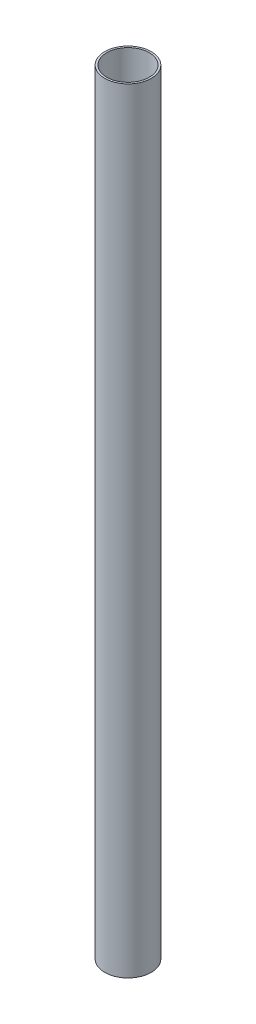
ISO-10303-21;
HEADER;
FILE_DESCRIPTION(('STEP AP214'),'2;1');
FILE_NAME('part.step','',(''),(''),'','','');
FILE_SCHEMA(('AUTOMOTIVE_DESIGN { 1 0 10303 214 1 1 1 1 }'));
ENDSEC;
DATA;
#1=APPLICATION_CONTEXT('core data for automotive mechanical design processes');
#2=APPLICATION_PROTOCOL_DEFINITION('international standard','automotive_design',2000,#1);
#3=PRODUCT_CONTEXT('',#1,'mechanical');
#4=PRODUCT('Part','Part','',(#3));
#5=PRODUCT_RELATED_PRODUCT_CATEGORY('part','',(#4));
#6=PRODUCT_DEFINITION_FORMATION('','',#4);
#7=PRODUCT_DEFINITION_CONTEXT('part definition',#1,'design');
#8=PRODUCT_DEFINITION('design','',#6,#7);
#9=PRODUCT_DEFINITION_SHAPE('','',#8);
#10=(LENGTH_UNIT() NAMED_UNIT(*) SI_UNIT(.MILLI.,.METRE.));
#11=(NAMED_UNIT(*) PLANE_ANGLE_UNIT() SI_UNIT($,.RADIAN.));
#12=(NAMED_UNIT(*) SI_UNIT($,.STERADIAN.) SOLID_ANGLE_UNIT());
#13=UNCERTAINTY_MEASURE_WITH_UNIT(LENGTH_MEASURE(1.E-05),#10,'distance_accuracy_value','');
#14=(GEOMETRIC_REPRESENTATION_CONTEXT(3) GLOBAL_UNCERTAINTY_ASSIGNED_CONTEXT((#13)) GLOBAL_UNIT_ASSIGNED_CONTEXT((#10,
#11,#12)) REPRESENTATION_CONTEXT('',''));
#15=CARTESIAN_POINT('',(0.,0.,0.));
#16=DIRECTION('',(0.,0.,1.));
#17=DIRECTION('',(1.,0.,0.));
#18=AXIS2_PLACEMENT_3D('',#15,#16,#17);
#19=CARTESIAN_POINT('',(0.,-60.,0.));
#20=DIRECTION('',(0.,1.,0.));
#21=DIRECTION('',(0.,0.,1.));
#22=AXIS2_PLACEMENT_3D('',#19,#20,#21);
#23=CYLINDRICAL_SURFACE('',#22,30.);
#24=CARTESIAN_POINT('',(0.,-60.,0.));
#25=DIRECTION('',(0.,1.,0.));
#26=DIRECTION('',(0.,0.,1.));
#27=AXIS2_PLACEMENT_3D('',#24,#25,#26);
#28=CIRCLE('',#27,30.);
#29=CARTESIAN_POINT('',(0.,-60.,30.));
#30=VERTEX_POINT('',#29);
#31=EDGE_CURVE('E12',#30,#30,#28,.T.);
#32=ORIENTED_EDGE('',*,*,#31,.T.);
#33=EDGE_LOOP('',(#32));
#34=FACE_BOUND('',#33,.T.);
#35=CARTESIAN_POINT('',(0.,940.,0.));
#36=DIRECTION('',(0.,1.,0.));
#37=DIRECTION('',(0.,0.,1.));
#38=AXIS2_PLACEMENT_3D('',#35,#36,#37);
#39=CIRCLE('',#38,30.);
#40=CARTESIAN_POINT('',(0.,940.,30.));
#41=VERTEX_POINT('',#40);
#42=EDGE_CURVE('E52',#41,#41,#39,.T.);
#43=ORIENTED_EDGE('',*,*,#42,.F.);
#44=EDGE_LOOP('',(#43));
#45=FACE_BOUND('',#44,.T.);
#46=ADVANCED_FACE('F42',(#34,#45),#23,.T.);
#47=CARTESIAN_POINT('',(0.,-60.,0.));
#48=DIRECTION('',(0.,1.,0.));
#49=DIRECTION('',(0.,0.,1.));
#50=AXIS2_PLACEMENT_3D('',#47,#48,#49);
#51=PLANE('',#50);
#52=CARTESIAN_POINT('',(0.,-60.,0.));
#53=DIRECTION('',(0.,1.,0.));
#54=DIRECTION('',(0.,0.,1.));
#55=AXIS2_PLACEMENT_3D('',#52,#53,#54);
#56=CIRCLE('',#55,27.5);
#57=CARTESIAN_POINT('',(0.,-60.,27.5));
#58=VERTEX_POINT('',#57);
#59=EDGE_CURVE('E48',#58,#58,#56,.T.);
#60=ORIENTED_EDGE('',*,*,#59,.T.);
#61=EDGE_LOOP('',(#60));
#62=FACE_BOUND('',#61,.T.);
#63=ORIENTED_EDGE('',*,*,#31,.F.);
#64=EDGE_LOOP('',(#63));
#65=FACE_BOUND('',#64,.T.);
#66=ADVANCED_FACE('F71',(#62,#65),#51,.F.);
#67=CARTESIAN_POINT('',(0.,-60.,0.));
#68=DIRECTION('',(0.,1.,0.));
#69=DIRECTION('',(0.,0.,1.));
#70=AXIS2_PLACEMENT_3D('',#67,#68,#69);
#71=CYLINDRICAL_SURFACE('',#70,27.5);
#72=ORIENTED_EDGE('',*,*,#59,.F.);
#73=EDGE_LOOP('',(#72));
#74=FACE_BOUND('',#73,.T.);
#75=CARTESIAN_POINT('',(0.,940.,0.));
#76=DIRECTION('',(0.,1.,0.));
#77=DIRECTION('',(0.,0.,1.));
#78=AXIS2_PLACEMENT_3D('',#75,#76,#77);
#79=CIRCLE('',#78,27.5);
#80=CARTESIAN_POINT('',(0.,940.,27.5));
#81=VERTEX_POINT('',#80);
#82=EDGE_CURVE('E56',#81,#81,#79,.T.);
#83=ORIENTED_EDGE('',*,*,#82,.T.);
#84=EDGE_LOOP('',(#83));
#85=FACE_BOUND('',#84,.T.);
#86=ADVANCED_FACE('F62',(#74,#85),#71,.F.);
#87=CARTESIAN_POINT('',(0.,940.,0.));
#88=DIRECTION('',(0.,1.,0.));
#89=DIRECTION('',(0.,0.,1.));
#90=AXIS2_PLACEMENT_3D('',#87,#88,#89);
#91=PLANE('',#90);
#92=ORIENTED_EDGE('',*,*,#42,.T.);
#93=EDGE_LOOP('',(#92));
#94=FACE_BOUND('',#93,.T.);
#95=ORIENTED_EDGE('',*,*,#82,.F.);
#96=EDGE_LOOP('',(#95));
#97=FACE_BOUND('',#96,.T.);
#98=ADVANCED_FACE('F64',(#94,#97),#91,.T.);
#99=CLOSED_SHELL('',(#46,#66,#86,#98));
#100=MANIFOLD_SOLID_BREP('B2',#99);
#101=ADVANCED_BREP_SHAPE_REPRESENTATION('',(#18,#100),#14);
#102=SHAPE_DEFINITION_REPRESENTATION(#9,#101);
ENDSEC;
END-ISO-10303-21;
